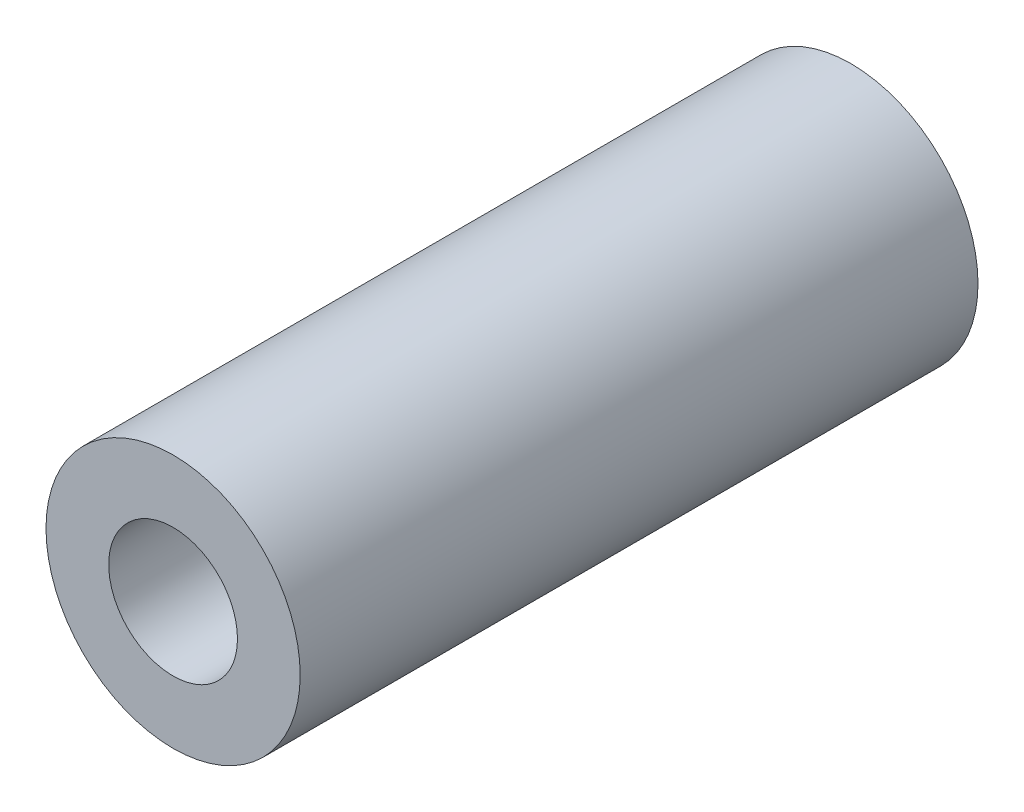
ISO-10303-21;
HEADER;
FILE_DESCRIPTION(('STEP AP214'),'2;1');
FILE_NAME('part.step','',(''),(''),'','','');
FILE_SCHEMA(('AUTOMOTIVE_DESIGN { 1 0 10303 214 1 1 1 1 }'));
ENDSEC;
DATA;
#1=APPLICATION_CONTEXT('core data for automotive mechanical design processes');
#2=APPLICATION_PROTOCOL_DEFINITION('international standard','automotive_design',2000,#1);
#3=PRODUCT_CONTEXT('',#1,'mechanical');
#4=PRODUCT('Part','Part','',(#3));
#5=PRODUCT_RELATED_PRODUCT_CATEGORY('part','',(#4));
#6=PRODUCT_DEFINITION_FORMATION('','',#4);
#7=PRODUCT_DEFINITION_CONTEXT('part definition',#1,'design');
#8=PRODUCT_DEFINITION('design','',#6,#7);
#9=PRODUCT_DEFINITION_SHAPE('','',#8);
#10=(LENGTH_UNIT() NAMED_UNIT(*) SI_UNIT(.MILLI.,.METRE.));
#11=(NAMED_UNIT(*) PLANE_ANGLE_UNIT() SI_UNIT($,.RADIAN.));
#12=(NAMED_UNIT(*) SI_UNIT($,.STERADIAN.) SOLID_ANGLE_UNIT());
#13=UNCERTAINTY_MEASURE_WITH_UNIT(LENGTH_MEASURE(1.E-05),#10,'distance_accuracy_value','');
#14=(GEOMETRIC_REPRESENTATION_CONTEXT(3) GLOBAL_UNCERTAINTY_ASSIGNED_CONTEXT((#13)) GLOBAL_UNIT_ASSIGNED_CONTEXT((#10,
#11,#12)) REPRESENTATION_CONTEXT('',''));
#15=CARTESIAN_POINT('',(0.,0.,0.));
#16=DIRECTION('',(0.,0.,1.));
#17=DIRECTION('',(1.,0.,0.));
#18=AXIS2_PLACEMENT_3D('',#15,#16,#17);
#19=CARTESIAN_POINT('',(0.,0.,25.4));
#20=DIRECTION('',(0.,0.,1.));
#21=DIRECTION('',(1.,0.,0.));
#22=AXIS2_PLACEMENT_3D('',#19,#20,#21);
#23=PLANE('',#22);
#24=CARTESIAN_POINT('',(0.,0.,25.4));
#25=DIRECTION('',(0.,0.,1.));
#26=DIRECTION('',(1.,0.,0.));
#27=AXIS2_PLACEMENT_3D('',#24,#25,#26);
#28=CIRCLE('',#27,9.525);
#29=CARTESIAN_POINT('',(9.525,0.,25.4));
#30=VERTEX_POINT('',#29);
#31=EDGE_CURVE('E10',#30,#30,#28,.T.);
#32=ORIENTED_EDGE('',*,*,#31,.T.);
#33=EDGE_LOOP('',(#32));
#34=FACE_BOUND('',#33,.T.);
#35=CARTESIAN_POINT('',(0.,0.,25.4));
#36=DIRECTION('',(0.,0.,1.));
#37=DIRECTION('',(1.,0.,0.));
#38=AXIS2_PLACEMENT_3D('',#35,#36,#37);
#39=CIRCLE('',#38,4.826);
#40=CARTESIAN_POINT('',(4.826,0.,25.4));
#41=VERTEX_POINT('',#40);
#42=EDGE_CURVE('E41',#41,#41,#39,.T.);
#43=ORIENTED_EDGE('',*,*,#42,.F.);
#44=EDGE_LOOP('',(#43));
#45=FACE_BOUND('',#44,.T.);
#46=ADVANCED_FACE('F30',(#34,#45),#23,.T.);
#47=CARTESIAN_POINT('',(0.,1.11022302462516E-13,-25.4));
#48=DIRECTION('',(0.,0.,1.));
#49=DIRECTION('',(1.,0.,0.));
#50=AXIS2_PLACEMENT_3D('',#47,#48,#49);
#51=PLANE('',#50);
#52=CARTESIAN_POINT('',(0.,1.11022302462516E-13,-25.4));
#53=DIRECTION('',(0.,0.,1.));
#54=DIRECTION('',(1.,0.,0.));
#55=AXIS2_PLACEMENT_3D('',#52,#53,#54);
#56=CIRCLE('',#55,9.525);
#57=CARTESIAN_POINT('',(9.525,1.11022771326105E-13,-25.4));
#58=VERTEX_POINT('',#57);
#59=EDGE_CURVE('E34',#58,#58,#56,.T.);
#60=ORIENTED_EDGE('',*,*,#59,.F.);
#61=EDGE_LOOP('',(#60));
#62=FACE_BOUND('',#61,.T.);
#63=CARTESIAN_POINT('',(0.,1.11022302462516E-13,-25.4));
#64=DIRECTION('',(0.,0.,1.));
#65=DIRECTION('',(1.,0.,0.));
#66=AXIS2_PLACEMENT_3D('',#63,#64,#65);
#67=CIRCLE('',#66,4.826);
#68=CARTESIAN_POINT('',(4.826,1.11022540020068E-13,-25.4));
#69=VERTEX_POINT('',#68);
#70=EDGE_CURVE('E43',#69,#69,#67,.T.);
#71=ORIENTED_EDGE('',*,*,#70,.T.);
#72=EDGE_LOOP('',(#71));
#73=FACE_BOUND('',#72,.T.);
#74=ADVANCED_FACE('F53',(#62,#73),#51,.F.);
#75=CARTESIAN_POINT('',(0.,0.,25.4));
#76=DIRECTION('',(0.,0.,-1.));
#77=DIRECTION('',(-1.,0.,0.));
#78=AXIS2_PLACEMENT_3D('',#75,#76,#77);
#79=CYLINDRICAL_SURFACE('',#78,9.525);
#80=ORIENTED_EDGE('',*,*,#31,.F.);
#81=EDGE_LOOP('',(#80));
#82=FACE_BOUND('',#81,.T.);
#83=ORIENTED_EDGE('',*,*,#59,.T.);
#84=EDGE_LOOP('',(#83));
#85=FACE_BOUND('',#84,.T.);
#86=ADVANCED_FACE('F32',(#82,#85),#79,.T.);
#87=CARTESIAN_POINT('',(0.,0.,25.4));
#88=DIRECTION('',(0.,0.,-1.));
#89=DIRECTION('',(-1.,0.,0.));
#90=AXIS2_PLACEMENT_3D('',#87,#88,#89);
#91=CYLINDRICAL_SURFACE('',#90,4.826);
#92=ORIENTED_EDGE('',*,*,#42,.T.);
#93=EDGE_LOOP('',(#92));
#94=FACE_BOUND('',#93,.T.);
#95=ORIENTED_EDGE('',*,*,#70,.F.);
#96=EDGE_LOOP('',(#95));
#97=FACE_BOUND('',#96,.T.);
#98=ADVANCED_FACE('F49',(#94,#97),#91,.F.);
#99=CLOSED_SHELL('',(#46,#74,#86,#98));
#100=MANIFOLD_SOLID_BREP('B2',#99);
#101=ADVANCED_BREP_SHAPE_REPRESENTATION('',(#18,#100),#14);
#102=SHAPE_DEFINITION_REPRESENTATION(#9,#101);
ENDSEC;
END-ISO-10303-21;
